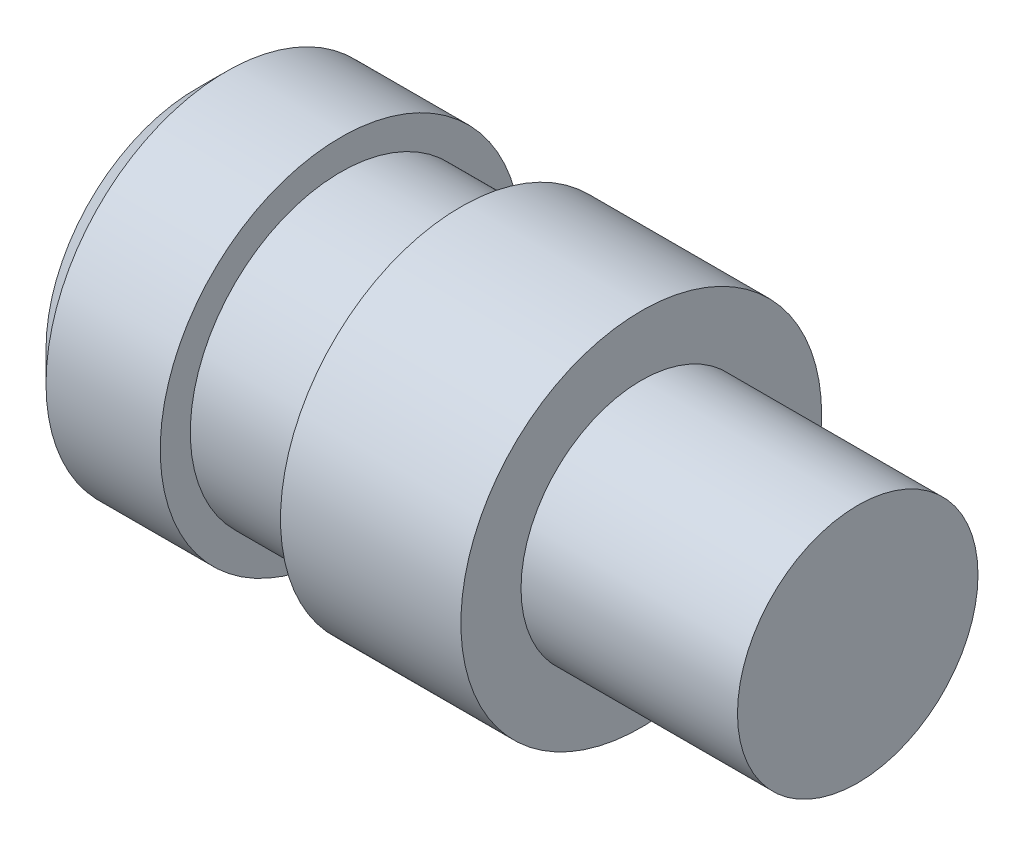
ISO-10303-21;
HEADER;
FILE_DESCRIPTION(('STEP AP214'),'2;1');
FILE_NAME('part.step','',(''),(''),'','','');
FILE_SCHEMA(('AUTOMOTIVE_DESIGN { 1 0 10303 214 1 1 1 1 }'));
ENDSEC;
DATA;
#1=APPLICATION_CONTEXT('core data for automotive mechanical design processes');
#2=APPLICATION_PROTOCOL_DEFINITION('international standard','automotive_design',2000,#1);
#3=PRODUCT_CONTEXT('',#1,'mechanical');
#4=PRODUCT('Part','Part','',(#3));
#5=PRODUCT_RELATED_PRODUCT_CATEGORY('part','',(#4));
#6=PRODUCT_DEFINITION_FORMATION('','',#4);
#7=PRODUCT_DEFINITION_CONTEXT('part definition',#1,'design');
#8=PRODUCT_DEFINITION('design','',#6,#7);
#9=PRODUCT_DEFINITION_SHAPE('','',#8);
#10=(LENGTH_UNIT() NAMED_UNIT(*) SI_UNIT(.MILLI.,.METRE.));
#11=(NAMED_UNIT(*) PLANE_ANGLE_UNIT() SI_UNIT($,.RADIAN.));
#12=(NAMED_UNIT(*) SI_UNIT($,.STERADIAN.) SOLID_ANGLE_UNIT());
#13=UNCERTAINTY_MEASURE_WITH_UNIT(LENGTH_MEASURE(1.E-05),#10,'distance_accuracy_value','');
#14=(GEOMETRIC_REPRESENTATION_CONTEXT(3) GLOBAL_UNCERTAINTY_ASSIGNED_CONTEXT((#13)) GLOBAL_UNIT_ASSIGNED_CONTEXT((#10,
#11,#12)) REPRESENTATION_CONTEXT('',''));
#15=CARTESIAN_POINT('',(0.,0.,0.));
#16=DIRECTION('',(0.,0.,1.));
#17=DIRECTION('',(1.,0.,0.));
#18=AXIS2_PLACEMENT_3D('',#15,#16,#17);
#19=CARTESIAN_POINT('',(0.,0.,0.));
#20=DIRECTION('',(-1.,0.,0.));
#21=DIRECTION('',(0.,0.,1.));
#22=AXIS2_PLACEMENT_3D('',#19,#20,#21);
#23=PLANE('',#22);
#24=CARTESIAN_POINT('',(0.,0.,0.));
#25=DIRECTION('',(-1.,0.,0.));
#26=DIRECTION('',(0.,0.,1.));
#27=AXIS2_PLACEMENT_3D('',#24,#25,#26);
#28=CIRCLE('',#27,2.5);
#29=CARTESIAN_POINT('',(0.,0.,2.5));
#30=VERTEX_POINT('',#29);
#31=EDGE_CURVE('E10',#30,#30,#28,.T.);
#32=ORIENTED_EDGE('',*,*,#31,.T.);
#33=EDGE_LOOP('',(#32));
#34=FACE_BOUND('',#33,.T.);
#35=ADVANCED_FACE('F37',(#34),#23,.T.);
#36=CARTESIAN_POINT('',(11.,0.,0.));
#37=DIRECTION('',(1.,0.,0.));
#38=DIRECTION('',(0.,0.,-1.));
#39=AXIS2_PLACEMENT_3D('',#36,#37,#38);
#40=CYLINDRICAL_SURFACE('',#39,3.);
#41=CARTESIAN_POINT('',(0.499999999999999,0.,0.));
#42=DIRECTION('',(-1.,0.,0.));
#43=DIRECTION('',(0.,0.,1.));
#44=AXIS2_PLACEMENT_3D('',#41,#42,#43);
#45=CIRCLE('',#44,3.);
#46=CARTESIAN_POINT('',(0.499999999999999,0.,3.));
#47=VERTEX_POINT('',#46);
#48=EDGE_CURVE('E44',#47,#47,#45,.F.);
#49=ORIENTED_EDGE('',*,*,#48,.T.);
#50=EDGE_LOOP('',(#49));
#51=FACE_BOUND('',#50,.T.);
#52=CARTESIAN_POINT('',(2.4,0.,0.));
#53=DIRECTION('',(1.,0.,0.));
#54=DIRECTION('',(0.,0.,-1.));
#55=AXIS2_PLACEMENT_3D('',#52,#53,#54);
#56=CIRCLE('',#55,3.);
#57=CARTESIAN_POINT('',(2.4,0.,-3.));
#58=VERTEX_POINT('',#57);
#59=EDGE_CURVE('E48',#58,#58,#56,.T.);
#60=ORIENTED_EDGE('',*,*,#59,.F.);
#61=EDGE_LOOP('',(#60));
#62=FACE_BOUND('',#61,.T.);
#63=ADVANCED_FACE('F89',(#51,#62),#40,.T.);
#64=CARTESIAN_POINT('',(2.4,3.,0.));
#65=DIRECTION('',(1.,0.,0.));
#66=DIRECTION('',(0.,0.,-1.));
#67=AXIS2_PLACEMENT_3D('',#64,#65,#66);
#68=PLANE('',#67);
#69=ORIENTED_EDGE('',*,*,#59,.T.);
#70=EDGE_LOOP('',(#69));
#71=FACE_BOUND('',#70,.T.);
#72=CARTESIAN_POINT('',(2.4,0.,0.));
#73=DIRECTION('',(1.,0.,0.));
#74=DIRECTION('',(0.,0.,-1.));
#75=AXIS2_PLACEMENT_3D('',#72,#73,#74);
#76=CIRCLE('',#75,2.5);
#77=CARTESIAN_POINT('',(2.4,0.,-2.5));
#78=VERTEX_POINT('',#77);
#79=EDGE_CURVE('E52',#78,#78,#76,.T.);
#80=ORIENTED_EDGE('',*,*,#79,.F.);
#81=EDGE_LOOP('',(#80));
#82=FACE_BOUND('',#81,.T.);
#83=ADVANCED_FACE('F93',(#71,#82),#68,.T.);
#84=CARTESIAN_POINT('',(11.,0.,0.));
#85=DIRECTION('',(1.,0.,0.));
#86=DIRECTION('',(0.,0.,-1.));
#87=AXIS2_PLACEMENT_3D('',#84,#85,#86);
#88=CYLINDRICAL_SURFACE('',#87,2.5);
#89=ORIENTED_EDGE('',*,*,#79,.T.);
#90=EDGE_LOOP('',(#89));
#91=FACE_BOUND('',#90,.T.);
#92=CARTESIAN_POINT('',(4.4,0.,0.));
#93=DIRECTION('',(1.,0.,0.));
#94=DIRECTION('',(0.,0.,-1.));
#95=AXIS2_PLACEMENT_3D('',#92,#93,#94);
#96=CIRCLE('',#95,2.5);
#97=CARTESIAN_POINT('',(4.4,0.,-2.5));
#98=VERTEX_POINT('',#97);
#99=EDGE_CURVE('E57',#98,#98,#96,.T.);
#100=ORIENTED_EDGE('',*,*,#99,.F.);
#101=EDGE_LOOP('',(#100));
#102=FACE_BOUND('',#101,.T.);
#103=ADVANCED_FACE('F98',(#91,#102),#88,.T.);
#104=CARTESIAN_POINT('',(4.4,2.5,0.));
#105=DIRECTION('',(-1.,0.,0.));
#106=DIRECTION('',(0.,0.,1.));
#107=AXIS2_PLACEMENT_3D('',#104,#105,#106);
#108=PLANE('',#107);
#109=ORIENTED_EDGE('',*,*,#99,.T.);
#110=EDGE_LOOP('',(#109));
#111=FACE_BOUND('',#110,.T.);
#112=CARTESIAN_POINT('',(4.4,0.,0.));
#113=DIRECTION('',(1.,0.,0.));
#114=DIRECTION('',(0.,0.,-1.));
#115=AXIS2_PLACEMENT_3D('',#112,#113,#114);
#116=CIRCLE('',#115,3.);
#117=CARTESIAN_POINT('',(4.4,0.,-3.));
#118=VERTEX_POINT('',#117);
#119=EDGE_CURVE('E60',#118,#118,#116,.T.);
#120=ORIENTED_EDGE('',*,*,#119,.F.);
#121=EDGE_LOOP('',(#120));
#122=FACE_BOUND('',#121,.T.);
#123=ADVANCED_FACE('F102',(#111,#122),#108,.T.);
#124=CARTESIAN_POINT('',(11.,0.,0.));
#125=DIRECTION('',(1.,0.,0.));
#126=DIRECTION('',(0.,0.,-1.));
#127=AXIS2_PLACEMENT_3D('',#124,#125,#126);
#128=CYLINDRICAL_SURFACE('',#127,3.);
#129=ORIENTED_EDGE('',*,*,#119,.T.);
#130=EDGE_LOOP('',(#129));
#131=FACE_BOUND('',#130,.T.);
#132=CARTESIAN_POINT('',(7.4,0.,0.));
#133=DIRECTION('',(1.,0.,0.));
#134=DIRECTION('',(0.,0.,-1.));
#135=AXIS2_PLACEMENT_3D('',#132,#133,#134);
#136=CIRCLE('',#135,3.);
#137=CARTESIAN_POINT('',(7.4,0.,-3.));
#138=VERTEX_POINT('',#137);
#139=EDGE_CURVE('E63',#138,#138,#136,.T.);
#140=ORIENTED_EDGE('',*,*,#139,.F.);
#141=EDGE_LOOP('',(#140));
#142=FACE_BOUND('',#141,.T.);
#143=ADVANCED_FACE('F85',(#131,#142),#128,.T.);
#144=CARTESIAN_POINT('',(7.4,3.,0.));
#145=DIRECTION('',(1.,0.,0.));
#146=DIRECTION('',(0.,0.,-1.));
#147=AXIS2_PLACEMENT_3D('',#144,#145,#146);
#148=PLANE('',#147);
#149=ORIENTED_EDGE('',*,*,#139,.T.);
#150=EDGE_LOOP('',(#149));
#151=FACE_BOUND('',#150,.T.);
#152=CARTESIAN_POINT('',(7.4,0.,0.));
#153=DIRECTION('',(1.,0.,0.));
#154=DIRECTION('',(0.,0.,-1.));
#155=AXIS2_PLACEMENT_3D('',#152,#153,#154);
#156=CIRCLE('',#155,2.);
#157=CARTESIAN_POINT('',(7.4,0.,-2.));
#158=VERTEX_POINT('',#157);
#159=EDGE_CURVE('E66',#158,#158,#156,.T.);
#160=ORIENTED_EDGE('',*,*,#159,.F.);
#161=EDGE_LOOP('',(#160));
#162=FACE_BOUND('',#161,.T.);
#163=ADVANCED_FACE('F77',(#151,#162),#148,.T.);
#164=CARTESIAN_POINT('',(11.,0.,0.));
#165=DIRECTION('',(1.,0.,0.));
#166=DIRECTION('',(0.,0.,-1.));
#167=AXIS2_PLACEMENT_3D('',#164,#165,#166);
#168=CYLINDRICAL_SURFACE('',#167,2.);
#169=ORIENTED_EDGE('',*,*,#159,.T.);
#170=EDGE_LOOP('',(#169));
#171=FACE_BOUND('',#170,.T.);
#172=CARTESIAN_POINT('',(11.,0.,0.));
#173=DIRECTION('',(1.,0.,0.));
#174=DIRECTION('',(0.,0.,-1.));
#175=AXIS2_PLACEMENT_3D('',#172,#173,#174);
#176=CIRCLE('',#175,2.);
#177=CARTESIAN_POINT('',(11.,0.,-2.));
#178=VERTEX_POINT('',#177);
#179=EDGE_CURVE('E69',#178,#178,#176,.T.);
#180=ORIENTED_EDGE('',*,*,#179,.F.);
#181=EDGE_LOOP('',(#180));
#182=FACE_BOUND('',#181,.T.);
#183=ADVANCED_FACE('F75',(#171,#182),#168,.T.);
#184=CARTESIAN_POINT('',(11.,2.,0.));
#185=DIRECTION('',(1.,0.,0.));
#186=DIRECTION('',(0.,0.,-1.));
#187=AXIS2_PLACEMENT_3D('',#184,#185,#186);
#188=PLANE('',#187);
#189=ORIENTED_EDGE('',*,*,#179,.T.);
#190=EDGE_LOOP('',(#189));
#191=FACE_BOUND('',#190,.T.);
#192=ADVANCED_FACE('F73',(#191),#188,.T.);
#193=CARTESIAN_POINT('',(0.499999999999999,0.,0.));
#194=DIRECTION('',(1.,0.,0.));
#195=DIRECTION('',(0.,0.,-1.));
#196=AXIS2_PLACEMENT_3D('',#193,#194,#195);
#197=CONICAL_SURFACE('',#196,3.,0.78539816339745);
#198=ORIENTED_EDGE('',*,*,#31,.F.);
#199=EDGE_LOOP('',(#198));
#200=FACE_BOUND('',#199,.T.);
#201=ORIENTED_EDGE('',*,*,#48,.F.);
#202=EDGE_LOOP('',(#201));
#203=FACE_BOUND('',#202,.T.);
#204=ADVANCED_FACE('F39',(#200,#203),#197,.T.);
#205=CLOSED_SHELL('',(#35,#63,#83,#103,#123,#143,#163,#183,#192,#204));
#206=MANIFOLD_SOLID_BREP('B2',#205);
#207=ADVANCED_BREP_SHAPE_REPRESENTATION('',(#18,#206),#14);
#208=SHAPE_DEFINITION_REPRESENTATION(#9,#207);
ENDSEC;
END-ISO-10303-21;
